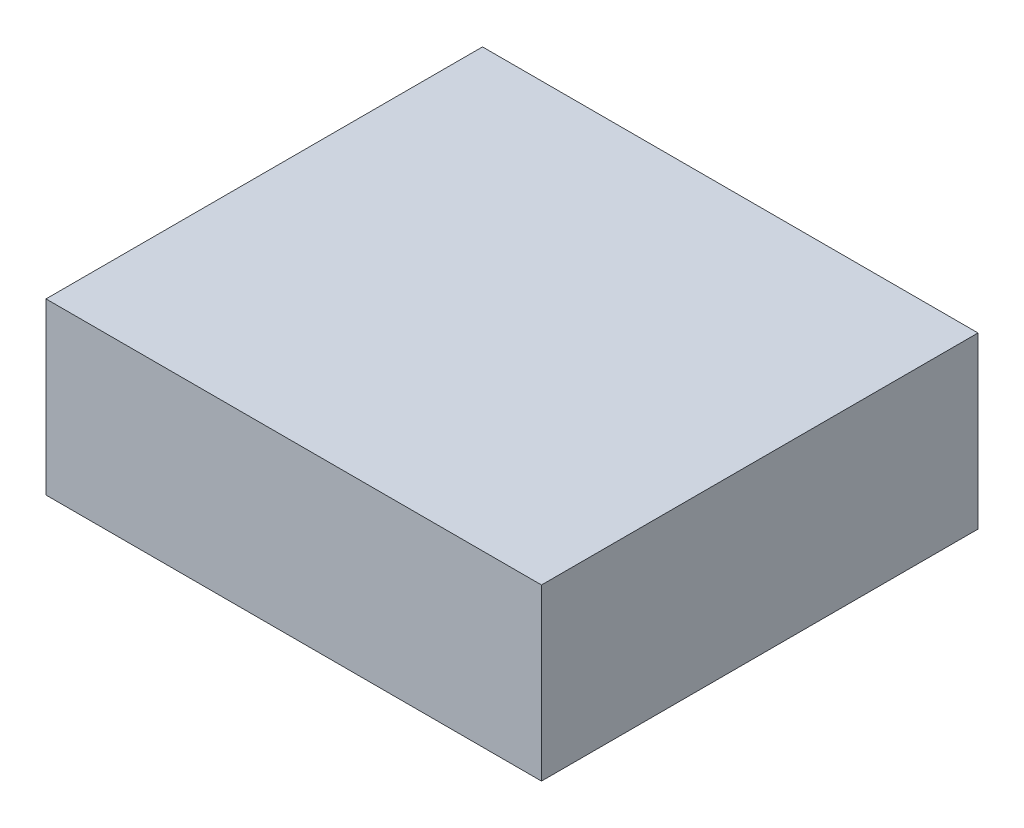
ISO-10303-21;
HEADER;
FILE_DESCRIPTION(('STEP AP214'),'2;1');
FILE_NAME('part.step','',(''),(''),'','','');
FILE_SCHEMA(('AUTOMOTIVE_DESIGN { 1 0 10303 214 1 1 1 1 }'));
ENDSEC;
DATA;
#1=APPLICATION_CONTEXT('core data for automotive mechanical design processes');
#2=APPLICATION_PROTOCOL_DEFINITION('international standard','automotive_design',2000,#1);
#3=PRODUCT_CONTEXT('',#1,'mechanical');
#4=PRODUCT('Part','Part','',(#3));
#5=PRODUCT_RELATED_PRODUCT_CATEGORY('part','',(#4));
#6=PRODUCT_DEFINITION_FORMATION('','',#4);
#7=PRODUCT_DEFINITION_CONTEXT('part definition',#1,'design');
#8=PRODUCT_DEFINITION('design','',#6,#7);
#9=PRODUCT_DEFINITION_SHAPE('','',#8);
#10=(LENGTH_UNIT() NAMED_UNIT(*) SI_UNIT(.MILLI.,.METRE.));
#11=(NAMED_UNIT(*) PLANE_ANGLE_UNIT() SI_UNIT($,.RADIAN.));
#12=(NAMED_UNIT(*) SI_UNIT($,.STERADIAN.) SOLID_ANGLE_UNIT());
#13=UNCERTAINTY_MEASURE_WITH_UNIT(LENGTH_MEASURE(1.E-05),#10,'distance_accuracy_value','');
#14=(GEOMETRIC_REPRESENTATION_CONTEXT(3) GLOBAL_UNCERTAINTY_ASSIGNED_CONTEXT((#13)) GLOBAL_UNIT_ASSIGNED_CONTEXT((#10,
#11,#12)) REPRESENTATION_CONTEXT('',''));
#15=CARTESIAN_POINT('',(0.,0.,0.));
#16=DIRECTION('',(0.,0.,1.));
#17=DIRECTION('',(1.,0.,0.));
#18=AXIS2_PLACEMENT_3D('',#15,#16,#17);
#19=CARTESIAN_POINT('',(0.,0.,92.5));
#20=DIRECTION('',(1.,0.,0.));
#21=DIRECTION('',(0.,0.,-1.));
#22=AXIS2_PLACEMENT_3D('',#19,#20,#21);
#23=PLANE('',#22);
#24=DIRECTION('',(0.,-1.,0.));
#25=VECTOR('',#24,1.);
#26=CARTESIAN_POINT('',(0.,0.,0.));
#27=LINE('',#26,#25);
#28=CARTESIAN_POINT('',(0.,36.,0.));
#29=VERTEX_POINT('',#28);
#30=CARTESIAN_POINT('',(0.,0.,0.));
#31=VERTEX_POINT('',#30);
#32=EDGE_CURVE('E98',#29,#31,#27,.T.);
#33=ORIENTED_EDGE('',*,*,#32,.T.);
#34=DIRECTION('',(0.,0.,-1.));
#35=VECTOR('',#34,1.);
#36=CARTESIAN_POINT('',(0.,0.,92.5));
#37=LINE('',#36,#35);
#38=CARTESIAN_POINT('',(0.,0.,92.5));
#39=VERTEX_POINT('',#38);
#40=EDGE_CURVE('E11',#39,#31,#37,.T.);
#41=ORIENTED_EDGE('',*,*,#40,.F.);
#42=DIRECTION('',(0.,-1.,0.));
#43=VECTOR('',#42,1.);
#44=CARTESIAN_POINT('',(0.,0.,92.5));
#45=LINE('',#44,#43);
#46=CARTESIAN_POINT('',(0.,36.,92.5));
#47=VERTEX_POINT('',#46);
#48=EDGE_CURVE('E86',#47,#39,#45,.T.);
#49=ORIENTED_EDGE('',*,*,#48,.F.);
#50=DIRECTION('',(0.,0.,-1.));
#51=VECTOR('',#50,1.);
#52=CARTESIAN_POINT('',(0.,36.,92.5));
#53=LINE('',#52,#51);
#54=EDGE_CURVE('E94',#47,#29,#53,.T.);
#55=ORIENTED_EDGE('',*,*,#54,.T.);
#56=EDGE_LOOP('',(#33,#41,#49,#55));
#57=FACE_BOUND('',#56,.T.);
#58=ADVANCED_FACE('F35',(#57),#23,.F.);
#59=CARTESIAN_POINT('',(0.,0.,92.5));
#60=DIRECTION('',(0.,1.,0.));
#61=DIRECTION('',(0.,0.,1.));
#62=AXIS2_PLACEMENT_3D('',#59,#60,#61);
#63=PLANE('',#62);
#64=DIRECTION('',(1.,0.,0.));
#65=VECTOR('',#64,1.);
#66=CARTESIAN_POINT('',(0.,0.,0.));
#67=LINE('',#66,#65);
#68=CARTESIAN_POINT('',(105.,0.,0.));
#69=VERTEX_POINT('',#68);
#70=EDGE_CURVE('E90',#31,#69,#67,.T.);
#71=ORIENTED_EDGE('',*,*,#70,.T.);
#72=DIRECTION('',(0.,0.,-1.));
#73=VECTOR('',#72,1.);
#74=CARTESIAN_POINT('',(105.,0.,92.5));
#75=LINE('',#74,#73);
#76=CARTESIAN_POINT('',(105.,0.,92.5));
#77=VERTEX_POINT('',#76);
#78=EDGE_CURVE('E43',#77,#69,#75,.T.);
#79=ORIENTED_EDGE('',*,*,#78,.F.);
#80=DIRECTION('',(1.,0.,0.));
#81=VECTOR('',#80,1.);
#82=CARTESIAN_POINT('',(0.,0.,92.5));
#83=LINE('',#82,#81);
#84=EDGE_CURVE('E81',#39,#77,#83,.T.);
#85=ORIENTED_EDGE('',*,*,#84,.F.);
#86=ORIENTED_EDGE('',*,*,#40,.T.);
#87=EDGE_LOOP('',(#71,#79,#85,#86));
#88=FACE_BOUND('',#87,.T.);
#89=ADVANCED_FACE('F89',(#88),#63,.F.);
#90=CARTESIAN_POINT('',(105.,0.,92.5));
#91=DIRECTION('',(-1.,0.,0.));
#92=DIRECTION('',(0.,0.,1.));
#93=AXIS2_PLACEMENT_3D('',#90,#91,#92);
#94=PLANE('',#93);
#95=DIRECTION('',(0.,1.,0.));
#96=VECTOR('',#95,1.);
#97=CARTESIAN_POINT('',(105.,0.,0.));
#98=LINE('',#97,#96);
#99=CARTESIAN_POINT('',(105.,36.,0.));
#100=VERTEX_POINT('',#99);
#101=EDGE_CURVE('E68',#69,#100,#98,.T.);
#102=ORIENTED_EDGE('',*,*,#101,.T.);
#103=DIRECTION('',(0.,0.,-1.));
#104=VECTOR('',#103,1.);
#105=CARTESIAN_POINT('',(105.,36.,92.5));
#106=LINE('',#105,#104);
#107=CARTESIAN_POINT('',(105.,36.,92.5));
#108=VERTEX_POINT('',#107);
#109=EDGE_CURVE('E91',#108,#100,#106,.T.);
#110=ORIENTED_EDGE('',*,*,#109,.F.);
#111=DIRECTION('',(0.,1.,0.));
#112=VECTOR('',#111,1.);
#113=CARTESIAN_POINT('',(105.,0.,92.5));
#114=LINE('',#113,#112);
#115=EDGE_CURVE('E84',#77,#108,#114,.T.);
#116=ORIENTED_EDGE('',*,*,#115,.F.);
#117=ORIENTED_EDGE('',*,*,#78,.T.);
#118=EDGE_LOOP('',(#102,#110,#116,#117));
#119=FACE_BOUND('',#118,.T.);
#120=ADVANCED_FACE('F92',(#119),#94,.F.);
#121=CARTESIAN_POINT('',(0.,36.,92.5));
#122=DIRECTION('',(0.,-1.,0.));
#123=DIRECTION('',(0.,0.,-1.));
#124=AXIS2_PLACEMENT_3D('',#121,#122,#123);
#125=PLANE('',#124);
#126=DIRECTION('',(-1.,0.,0.));
#127=VECTOR('',#126,1.);
#128=CARTESIAN_POINT('',(0.,36.,0.));
#129=LINE('',#128,#127);
#130=EDGE_CURVE('E74',#100,#29,#129,.T.);
#131=ORIENTED_EDGE('',*,*,#130,.T.);
#132=ORIENTED_EDGE('',*,*,#54,.F.);
#133=DIRECTION('',(-1.,0.,0.));
#134=VECTOR('',#133,1.);
#135=CARTESIAN_POINT('',(0.,36.,92.5));
#136=LINE('',#135,#134);
#137=EDGE_CURVE('E51',#108,#47,#136,.T.);
#138=ORIENTED_EDGE('',*,*,#137,.F.);
#139=ORIENTED_EDGE('',*,*,#109,.T.);
#140=EDGE_LOOP('',(#131,#132,#138,#139));
#141=FACE_BOUND('',#140,.T.);
#142=ADVANCED_FACE('F105',(#141),#125,.F.);
#143=CARTESIAN_POINT('',(0.,36.,92.5));
#144=DIRECTION('',(0.,0.,-1.));
#145=DIRECTION('',(-1.,0.,0.));
#146=AXIS2_PLACEMENT_3D('',#143,#144,#145);
#147=PLANE('',#146);
#148=ORIENTED_EDGE('',*,*,#48,.T.);
#149=ORIENTED_EDGE('',*,*,#84,.T.);
#150=ORIENTED_EDGE('',*,*,#115,.T.);
#151=ORIENTED_EDGE('',*,*,#137,.T.);
#152=EDGE_LOOP('',(#148,#149,#150,#151));
#153=FACE_BOUND('',#152,.T.);
#154=ADVANCED_FACE('F82',(#153),#147,.F.);
#155=CARTESIAN_POINT('',(0.,36.,0.));
#156=DIRECTION('',(0.,0.,-1.));
#157=DIRECTION('',(-1.,0.,0.));
#158=AXIS2_PLACEMENT_3D('',#155,#156,#157);
#159=PLANE('',#158);
#160=ORIENTED_EDGE('',*,*,#32,.F.);
#161=ORIENTED_EDGE('',*,*,#130,.F.);
#162=ORIENTED_EDGE('',*,*,#101,.F.);
#163=ORIENTED_EDGE('',*,*,#70,.F.);
#164=EDGE_LOOP('',(#160,#161,#162,#163));
#165=FACE_BOUND('',#164,.T.);
#166=ADVANCED_FACE('F108',(#165),#159,.T.);
#167=CLOSED_SHELL('',(#58,#89,#120,#142,#154,#166));
#168=MANIFOLD_SOLID_BREP('B2',#167);
#169=ADVANCED_BREP_SHAPE_REPRESENTATION('',(#18,#168),#14);
#170=SHAPE_DEFINITION_REPRESENTATION(#9,#169);
ENDSEC;
END-ISO-10303-21;
